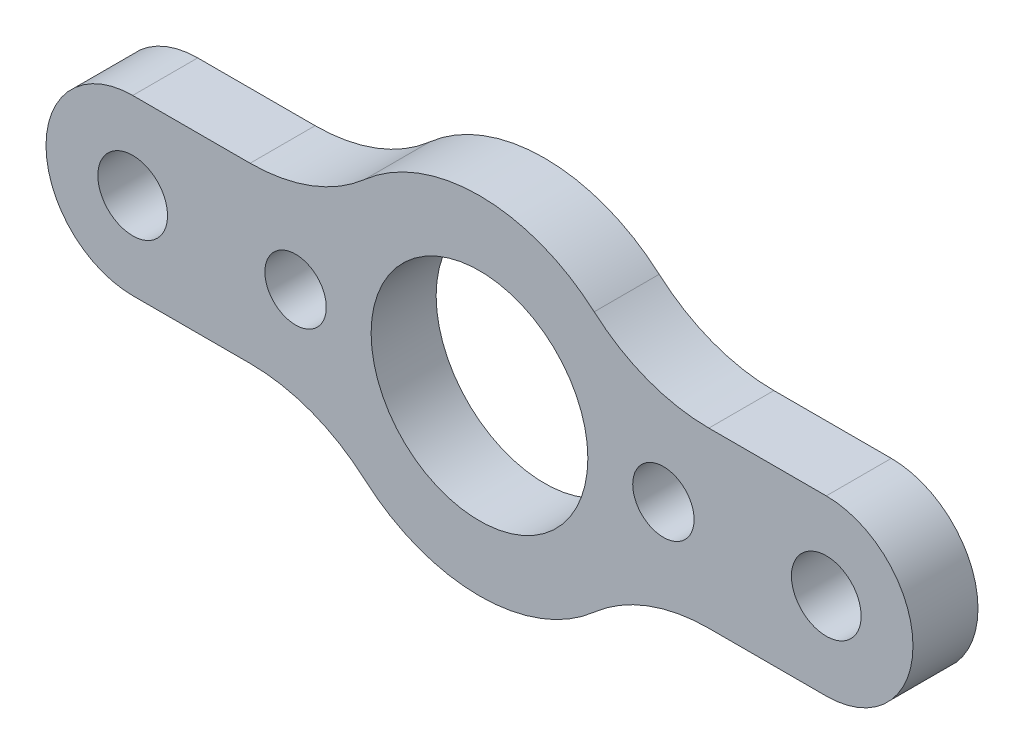
ISO-10303-21;
HEADER;
FILE_DESCRIPTION(('STEP AP214'),'2;1');
FILE_NAME('part.step','',(''),(''),'','','');
FILE_SCHEMA(('AUTOMOTIVE_DESIGN { 1 0 10303 214 1 1 1 1 }'));
ENDSEC;
DATA;
#1=APPLICATION_CONTEXT('core data for automotive mechanical design processes');
#2=APPLICATION_PROTOCOL_DEFINITION('international standard','automotive_design',2000,#1);
#3=PRODUCT_CONTEXT('',#1,'mechanical');
#4=PRODUCT('Part','Part','',(#3));
#5=PRODUCT_RELATED_PRODUCT_CATEGORY('part','',(#4));
#6=PRODUCT_DEFINITION_FORMATION('','',#4);
#7=PRODUCT_DEFINITION_CONTEXT('part definition',#1,'design');
#8=PRODUCT_DEFINITION('design','',#6,#7);
#9=PRODUCT_DEFINITION_SHAPE('','',#8);
#10=(LENGTH_UNIT() NAMED_UNIT(*) SI_UNIT(.MILLI.,.METRE.));
#11=(NAMED_UNIT(*) PLANE_ANGLE_UNIT() SI_UNIT($,.RADIAN.));
#12=(NAMED_UNIT(*) SI_UNIT($,.STERADIAN.) SOLID_ANGLE_UNIT());
#13=UNCERTAINTY_MEASURE_WITH_UNIT(LENGTH_MEASURE(1.E-05),#10,'distance_accuracy_value','');
#14=(GEOMETRIC_REPRESENTATION_CONTEXT(3) GLOBAL_UNCERTAINTY_ASSIGNED_CONTEXT((#13)) GLOBAL_UNIT_ASSIGNED_CONTEXT((#10,
#11,#12)) REPRESENTATION_CONTEXT('',''));
#15=CARTESIAN_POINT('',(0.,0.,0.));
#16=DIRECTION('',(0.,0.,1.));
#17=DIRECTION('',(1.,0.,0.));
#18=AXIS2_PLACEMENT_3D('',#15,#16,#17);
#19=CARTESIAN_POINT('',(16.8005208252602,19.05,0.));
#20=DIRECTION('',(0.,0.,-1.));
#21=DIRECTION('',(-1.,0.,0.));
#22=AXIS2_PLACEMENT_3D('',#19,#20,#21);
#23=PLANE('',#22);
#24=CARTESIAN_POINT('',(25.4,0.,0.));
#25=DIRECTION('',(0.,0.,-1.));
#26=DIRECTION('',(-1.,0.,0.));
#27=AXIS2_PLACEMENT_3D('',#24,#25,#26);
#28=CIRCLE('',#27,2.5527);
#29=CARTESIAN_POINT('',(22.8473,0.,0.));
#30=VERTEX_POINT('',#29);
#31=EDGE_CURVE('E179',#30,#30,#28,.F.);
#32=ORIENTED_EDGE('',*,*,#31,.T.);
#33=EDGE_LOOP('',(#32));
#34=FACE_BOUND('',#33,.T.);
#35=CARTESIAN_POINT('',(-13.4703841816037,0.,0.));
#36=DIRECTION('',(0.,0.,-1.));
#37=DIRECTION('',(-1.,0.,0.));
#38=AXIS2_PLACEMENT_3D('',#35,#36,#37);
#39=CIRCLE('',#38,2.2479);
#40=CARTESIAN_POINT('',(-15.7182841816037,0.,0.));
#41=VERTEX_POINT('',#40);
#42=EDGE_CURVE('E182',#41,#41,#39,.F.);
#43=ORIENTED_EDGE('',*,*,#42,.T.);
#44=EDGE_LOOP('',(#43));
#45=FACE_BOUND('',#44,.T.);
#46=CARTESIAN_POINT('',(0.,0.,0.));
#47=DIRECTION('',(0.,0.,-1.));
#48=DIRECTION('',(-1.,0.,0.));
#49=AXIS2_PLACEMENT_3D('',#46,#47,#48);
#50=CIRCLE('',#49,7.9375);
#51=CARTESIAN_POINT('',(-7.9375,0.,0.));
#52=VERTEX_POINT('',#51);
#53=EDGE_CURVE('E185',#52,#52,#50,.F.);
#54=ORIENTED_EDGE('',*,*,#53,.T.);
#55=EDGE_LOOP('',(#54));
#56=FACE_BOUND('',#55,.T.);
#57=CARTESIAN_POINT('',(-16.8005208252602,19.05,0.));
#58=DIRECTION('',(0.,0.,-1.));
#59=DIRECTION('',(-1.,0.,0.));
#60=AXIS2_PLACEMENT_3D('',#57,#58,#59);
#61=CIRCLE('',#60,12.7);
#62=CARTESIAN_POINT('',(-16.8005208252602,6.35,0.));
#63=VERTEX_POINT('',#62);
#64=CARTESIAN_POINT('',(-8.40026041263008,9.52499999999999,0.));
#65=VERTEX_POINT('',#64);
#66=EDGE_CURVE('E192',#63,#65,#61,.F.);
#67=ORIENTED_EDGE('',*,*,#66,.T.);
#68=CARTESIAN_POINT('',(0.,0.,0.));
#69=DIRECTION('',(0.,0.,-1.));
#70=DIRECTION('',(-1.,0.,0.));
#71=AXIS2_PLACEMENT_3D('',#68,#69,#70);
#72=CIRCLE('',#71,12.7);
#73=CARTESIAN_POINT('',(8.40026041263008,9.525,0.));
#74=VERTEX_POINT('',#73);
#75=EDGE_CURVE('E189',#74,#65,#72,.F.);
#76=ORIENTED_EDGE('',*,*,#75,.F.);
#77=CARTESIAN_POINT('',(16.8005208252602,19.05,0.));
#78=DIRECTION('',(0.,0.,-1.));
#79=DIRECTION('',(-1.,0.,0.));
#80=AXIS2_PLACEMENT_3D('',#77,#78,#79);
#81=CIRCLE('',#80,12.7);
#82=CARTESIAN_POINT('',(16.8005208252602,6.35,0.));
#83=VERTEX_POINT('',#82);
#84=EDGE_CURVE('E118',#74,#83,#81,.F.);
#85=ORIENTED_EDGE('',*,*,#84,.T.);
#86=DIRECTION('',(1.,0.,0.));
#87=VECTOR('',#86,1.);
#88=CARTESIAN_POINT('',(25.4,6.35000000000001,0.));
#89=LINE('',#88,#87);
#90=CARTESIAN_POINT('',(25.4,6.35,0.));
#91=VERTEX_POINT('',#90);
#92=EDGE_CURVE('E113',#83,#91,#89,.T.);
#93=ORIENTED_EDGE('',*,*,#92,.T.);
#94=CARTESIAN_POINT('',(25.4,0.,0.));
#95=DIRECTION('',(0.,0.,-1.));
#96=DIRECTION('',(-1.,0.,0.));
#97=AXIS2_PLACEMENT_3D('',#94,#95,#96);
#98=CIRCLE('',#97,6.35);
#99=CARTESIAN_POINT('',(25.4,-6.34999999999999,0.));
#100=VERTEX_POINT('',#99);
#101=EDGE_CURVE('E103',#100,#91,#98,.F.);
#102=ORIENTED_EDGE('',*,*,#101,.F.);
#103=DIRECTION('',(-1.,0.,0.));
#104=VECTOR('',#103,1.);
#105=CARTESIAN_POINT('',(25.4,-6.34999999999999,0.));
#106=LINE('',#105,#104);
#107=CARTESIAN_POINT('',(16.8005208252602,-6.35,0.));
#108=VERTEX_POINT('',#107);
#109=EDGE_CURVE('E129',#100,#108,#106,.T.);
#110=ORIENTED_EDGE('',*,*,#109,.T.);
#111=CARTESIAN_POINT('',(16.8005208252602,-19.05,0.));
#112=DIRECTION('',(0.,0.,-1.));
#113=DIRECTION('',(-1.,0.,0.));
#114=AXIS2_PLACEMENT_3D('',#111,#112,#113);
#115=CIRCLE('',#114,12.7);
#116=CARTESIAN_POINT('',(8.40026041263008,-9.525,0.));
#117=VERTEX_POINT('',#116);
#118=EDGE_CURVE('E202',#108,#117,#115,.F.);
#119=ORIENTED_EDGE('',*,*,#118,.T.);
#120=CARTESIAN_POINT('',(0.,0.,0.));
#121=DIRECTION('',(0.,0.,-1.));
#122=DIRECTION('',(-1.,0.,0.));
#123=AXIS2_PLACEMENT_3D('',#120,#121,#122);
#124=CIRCLE('',#123,12.7);
#125=CARTESIAN_POINT('',(-8.40026041263008,-9.525,0.));
#126=VERTEX_POINT('',#125);
#127=EDGE_CURVE('E199',#126,#117,#124,.F.);
#128=ORIENTED_EDGE('',*,*,#127,.F.);
#129=CARTESIAN_POINT('',(-16.8005208252602,-19.05,0.));
#130=DIRECTION('',(0.,0.,-1.));
#131=DIRECTION('',(-1.,0.,0.));
#132=AXIS2_PLACEMENT_3D('',#129,#130,#131);
#133=CIRCLE('',#132,12.7);
#134=CARTESIAN_POINT('',(-16.8005208252602,-6.35,0.));
#135=VERTEX_POINT('',#134);
#136=EDGE_CURVE('E196',#126,#135,#133,.F.);
#137=ORIENTED_EDGE('',*,*,#136,.T.);
#138=DIRECTION('',(-1.,0.,0.));
#139=VECTOR('',#138,1.);
#140=CARTESIAN_POINT('',(-25.4,-6.35,0.));
#141=LINE('',#140,#139);
#142=CARTESIAN_POINT('',(-25.4,-6.35,0.));
#143=VERTEX_POINT('',#142);
#144=EDGE_CURVE('E137',#135,#143,#141,.T.);
#145=ORIENTED_EDGE('',*,*,#144,.T.);
#146=CARTESIAN_POINT('',(-25.4,0.,0.));
#147=DIRECTION('',(0.,0.,-1.));
#148=DIRECTION('',(-1.,0.,0.));
#149=AXIS2_PLACEMENT_3D('',#146,#147,#148);
#150=CIRCLE('',#149,6.35);
#151=CARTESIAN_POINT('',(-25.4,6.35,0.));
#152=VERTEX_POINT('',#151);
#153=EDGE_CURVE('E194',#152,#143,#150,.F.);
#154=ORIENTED_EDGE('',*,*,#153,.F.);
#155=DIRECTION('',(1.,0.,0.));
#156=VECTOR('',#155,1.);
#157=CARTESIAN_POINT('',(-25.4,6.35,0.));
#158=LINE('',#157,#156);
#159=EDGE_CURVE('E133',#152,#63,#158,.T.);
#160=ORIENTED_EDGE('',*,*,#159,.T.);
#161=EDGE_LOOP('',(#67,#76,#85,#93,#102,#110,#119,#128,#137,#145,#154,#160));
#162=FACE_BOUND('',#161,.T.);
#163=CARTESIAN_POINT('',(13.4703841816037,0.,0.));
#164=DIRECTION('',(0.,0.,-1.));
#165=DIRECTION('',(-1.,0.,0.));
#166=AXIS2_PLACEMENT_3D('',#163,#164,#165);
#167=CIRCLE('',#166,2.2479);
#168=CARTESIAN_POINT('',(11.2224841816037,0.,0.));
#169=VERTEX_POINT('',#168);
#170=EDGE_CURVE('E122',#169,#169,#167,.F.);
#171=ORIENTED_EDGE('',*,*,#170,.T.);
#172=EDGE_LOOP('',(#171));
#173=FACE_BOUND('',#172,.T.);
#174=CARTESIAN_POINT('',(-25.4,0.,0.));
#175=DIRECTION('',(0.,0.,-1.));
#176=DIRECTION('',(-1.,0.,0.));
#177=AXIS2_PLACEMENT_3D('',#174,#175,#176);
#178=CIRCLE('',#177,2.5527);
#179=CARTESIAN_POINT('',(-27.9527,0.,0.));
#180=VERTEX_POINT('',#179);
#181=EDGE_CURVE('E20',#180,#180,#178,.F.);
#182=ORIENTED_EDGE('',*,*,#181,.T.);
#183=EDGE_LOOP('',(#182));
#184=FACE_BOUND('',#183,.T.);
#185=ADVANCED_FACE('F17',(#34,#45,#56,#162,#173,#184),#23,.T.);
#186=CARTESIAN_POINT('',(-25.4,0.,4.7625));
#187=DIRECTION('',(0.,0.,-1.));
#188=DIRECTION('',(-1.,0.,0.));
#189=AXIS2_PLACEMENT_3D('',#186,#187,#188);
#190=CYLINDRICAL_SURFACE('',#189,2.5527);
#191=ORIENTED_EDGE('',*,*,#181,.F.);
#192=EDGE_LOOP('',(#191));
#193=FACE_BOUND('',#192,.T.);
#194=CARTESIAN_POINT('',(-25.4,0.,4.7625));
#195=DIRECTION('',(0.,0.,-1.));
#196=DIRECTION('',(-1.,0.,0.));
#197=AXIS2_PLACEMENT_3D('',#194,#195,#196);
#198=CIRCLE('',#197,2.5527);
#199=CARTESIAN_POINT('',(-27.9527,0.,4.7625));
#200=VERTEX_POINT('',#199);
#201=EDGE_CURVE('E176',#200,#200,#198,.F.);
#202=ORIENTED_EDGE('',*,*,#201,.T.);
#203=EDGE_LOOP('',(#202));
#204=FACE_BOUND('',#203,.T.);
#205=ADVANCED_FACE('F210',(#193,#204),#190,.F.);
#206=CARTESIAN_POINT('',(13.4703841816037,0.,4.7625));
#207=DIRECTION('',(0.,0.,-1.));
#208=DIRECTION('',(-1.,0.,0.));
#209=AXIS2_PLACEMENT_3D('',#206,#207,#208);
#210=CYLINDRICAL_SURFACE('',#209,2.2479);
#211=ORIENTED_EDGE('',*,*,#170,.F.);
#212=EDGE_LOOP('',(#211));
#213=FACE_BOUND('',#212,.T.);
#214=CARTESIAN_POINT('',(13.4703841816037,0.,4.7625));
#215=DIRECTION('',(0.,0.,-1.));
#216=DIRECTION('',(-1.,0.,0.));
#217=AXIS2_PLACEMENT_3D('',#214,#215,#216);
#218=CIRCLE('',#217,2.2479);
#219=CARTESIAN_POINT('',(11.2224841816037,0.,4.7625));
#220=VERTEX_POINT('',#219);
#221=EDGE_CURVE('E173',#220,#220,#218,.F.);
#222=ORIENTED_EDGE('',*,*,#221,.T.);
#223=EDGE_LOOP('',(#222));
#224=FACE_BOUND('',#223,.T.);
#225=ADVANCED_FACE('F213',(#213,#224),#210,.F.);
#226=CARTESIAN_POINT('',(25.4,6.35000000000001,4.7625));
#227=DIRECTION('',(0.,-1.,0.));
#228=DIRECTION('',(1.,0.,0.));
#229=AXIS2_PLACEMENT_3D('',#226,#227,#228);
#230=PLANE('',#229);
#231=DIRECTION('',(0.,0.,-1.));
#232=VECTOR('',#231,1.);
#233=CARTESIAN_POINT('',(16.8005208252602,6.34999999999999,4.7625));
#234=LINE('',#233,#232);
#235=CARTESIAN_POINT('',(16.8005208252602,6.35,4.7625));
#236=VERTEX_POINT('',#235);
#237=EDGE_CURVE('E459',#83,#236,#234,.F.);
#238=ORIENTED_EDGE('',*,*,#237,.T.);
#239=DIRECTION('',(-1.,0.,0.));
#240=VECTOR('',#239,1.);
#241=CARTESIAN_POINT('',(16.8005208252602,6.35,4.7625));
#242=LINE('',#241,#240);
#243=CARTESIAN_POINT('',(25.4,6.35,4.7625));
#244=VERTEX_POINT('',#243);
#245=EDGE_CURVE('E127',#236,#244,#242,.F.);
#246=ORIENTED_EDGE('',*,*,#245,.T.);
#247=DIRECTION('',(0.,0.,-1.));
#248=VECTOR('',#247,1.);
#249=CARTESIAN_POINT('',(25.4,6.35,4.7625));
#250=LINE('',#249,#248);
#251=EDGE_CURVE('E110',#91,#244,#250,.F.);
#252=ORIENTED_EDGE('',*,*,#251,.F.);
#253=ORIENTED_EDGE('',*,*,#92,.F.);
#254=EDGE_LOOP('',(#238,#246,#252,#253));
#255=FACE_BOUND('',#254,.T.);
#256=ADVANCED_FACE('F125',(#255),#230,.F.);
#257=CARTESIAN_POINT('',(25.4,0.,4.7625));
#258=DIRECTION('',(0.,0.,-1.));
#259=DIRECTION('',(-1.,0.,0.));
#260=AXIS2_PLACEMENT_3D('',#257,#258,#259);
#261=CYLINDRICAL_SURFACE('',#260,6.35);
#262=CARTESIAN_POINT('',(25.4,0.,4.7625));
#263=DIRECTION('',(0.,0.,-1.));
#264=DIRECTION('',(-1.,0.,0.));
#265=AXIS2_PLACEMENT_3D('',#262,#263,#264);
#266=CIRCLE('',#265,6.35);
#267=CARTESIAN_POINT('',(25.4,-6.35,4.7625));
#268=VERTEX_POINT('',#267);
#269=EDGE_CURVE('E171',#244,#268,#266,.T.);
#270=ORIENTED_EDGE('',*,*,#269,.T.);
#271=DIRECTION('',(0.,0.,1.));
#272=VECTOR('',#271,1.);
#273=CARTESIAN_POINT('',(25.4,-6.34999999999999,4.7625));
#274=LINE('',#273,#272);
#275=EDGE_CURVE('E112',#268,#100,#274,.F.);
#276=ORIENTED_EDGE('',*,*,#275,.T.);
#277=ORIENTED_EDGE('',*,*,#101,.T.);
#278=ORIENTED_EDGE('',*,*,#251,.T.);
#279=EDGE_LOOP('',(#270,#276,#277,#278));
#280=FACE_BOUND('',#279,.T.);
#281=ADVANCED_FACE('F108',(#280),#261,.T.);
#282=CARTESIAN_POINT('',(25.4,-6.34999999999999,4.7625));
#283=DIRECTION('',(0.,1.,0.));
#284=DIRECTION('',(-1.,0.,0.));
#285=AXIS2_PLACEMENT_3D('',#282,#283,#284);
#286=PLANE('',#285);
#287=ORIENTED_EDGE('',*,*,#275,.F.);
#288=DIRECTION('',(-1.,0.,0.));
#289=VECTOR('',#288,1.);
#290=CARTESIAN_POINT('',(16.8005208252602,-6.35,4.7625));
#291=LINE('',#290,#289);
#292=CARTESIAN_POINT('',(16.8005208252602,-6.35,4.7625));
#293=VERTEX_POINT('',#292);
#294=EDGE_CURVE('E170',#268,#293,#291,.T.);
#295=ORIENTED_EDGE('',*,*,#294,.T.);
#296=DIRECTION('',(0.,0.,-1.));
#297=VECTOR('',#296,1.);
#298=CARTESIAN_POINT('',(16.8005208252602,-6.35,4.7625));
#299=LINE('',#298,#297);
#300=EDGE_CURVE('E142',#293,#108,#299,.T.);
#301=ORIENTED_EDGE('',*,*,#300,.T.);
#302=ORIENTED_EDGE('',*,*,#109,.F.);
#303=EDGE_LOOP('',(#287,#295,#301,#302));
#304=FACE_BOUND('',#303,.T.);
#305=ADVANCED_FACE('F272',(#304),#286,.F.);
#306=CARTESIAN_POINT('',(16.8005208252602,-19.05,4.7625));
#307=DIRECTION('',(0.,0.,-1.));
#308=DIRECTION('',(-1.,0.,0.));
#309=AXIS2_PLACEMENT_3D('',#306,#307,#308);
#310=CYLINDRICAL_SURFACE('',#309,12.7);
#311=ORIENTED_EDGE('',*,*,#300,.F.);
#312=CARTESIAN_POINT('',(16.8005208252602,-19.05,4.7625));
#313=DIRECTION('',(0.,0.,-1.));
#314=DIRECTION('',(-1.,0.,0.));
#315=AXIS2_PLACEMENT_3D('',#312,#313,#314);
#316=CIRCLE('',#315,12.7);
#317=CARTESIAN_POINT('',(8.40026041263008,-9.525,4.7625));
#318=VERTEX_POINT('',#317);
#319=EDGE_CURVE('E167',#293,#318,#316,.F.);
#320=ORIENTED_EDGE('',*,*,#319,.T.);
#321=DIRECTION('',(0.,0.,-1.));
#322=VECTOR('',#321,1.);
#323=CARTESIAN_POINT('',(8.40026041263008,-9.525,4.7625));
#324=LINE('',#323,#322);
#325=EDGE_CURVE('E201',#117,#318,#324,.F.);
#326=ORIENTED_EDGE('',*,*,#325,.F.);
#327=ORIENTED_EDGE('',*,*,#118,.F.);
#328=EDGE_LOOP('',(#311,#320,#326,#327));
#329=FACE_BOUND('',#328,.T.);
#330=ADVANCED_FACE('F268',(#329),#310,.F.);
#331=CARTESIAN_POINT('',(0.,0.,4.7625));
#332=DIRECTION('',(0.,0.,-1.));
#333=DIRECTION('',(-1.,0.,0.));
#334=AXIS2_PLACEMENT_3D('',#331,#332,#333);
#335=CYLINDRICAL_SURFACE('',#334,12.7);
#336=CARTESIAN_POINT('',(0.,0.,4.7625));
#337=DIRECTION('',(0.,0.,-1.));
#338=DIRECTION('',(-1.,0.,0.));
#339=AXIS2_PLACEMENT_3D('',#336,#337,#338);
#340=CIRCLE('',#339,12.7);
#341=CARTESIAN_POINT('',(-8.40026041263008,-9.525,4.7625));
#342=VERTEX_POINT('',#341);
#343=EDGE_CURVE('E164',#318,#342,#340,.T.);
#344=ORIENTED_EDGE('',*,*,#343,.T.);
#345=DIRECTION('',(0.,0.,-1.));
#346=VECTOR('',#345,1.);
#347=CARTESIAN_POINT('',(-8.40026041263008,-9.525,4.7625));
#348=LINE('',#347,#346);
#349=EDGE_CURVE('E198',#342,#126,#348,.T.);
#350=ORIENTED_EDGE('',*,*,#349,.T.);
#351=ORIENTED_EDGE('',*,*,#127,.T.);
#352=ORIENTED_EDGE('',*,*,#325,.T.);
#353=EDGE_LOOP('',(#344,#350,#351,#352));
#354=FACE_BOUND('',#353,.T.);
#355=ADVANCED_FACE('F264',(#354),#335,.T.);
#356=CARTESIAN_POINT('',(-16.8005208252602,-19.05,4.7625));
#357=DIRECTION('',(0.,0.,-1.));
#358=DIRECTION('',(-1.,0.,0.));
#359=AXIS2_PLACEMENT_3D('',#356,#357,#358);
#360=CYLINDRICAL_SURFACE('',#359,12.7);
#361=ORIENTED_EDGE('',*,*,#349,.F.);
#362=CARTESIAN_POINT('',(-16.8005208252602,-19.05,4.7625));
#363=DIRECTION('',(0.,0.,-1.));
#364=DIRECTION('',(-1.,0.,0.));
#365=AXIS2_PLACEMENT_3D('',#362,#363,#364);
#366=CIRCLE('',#365,12.7);
#367=CARTESIAN_POINT('',(-16.8005208252602,-6.35,4.7625));
#368=VERTEX_POINT('',#367);
#369=EDGE_CURVE('E161',#342,#368,#366,.F.);
#370=ORIENTED_EDGE('',*,*,#369,.T.);
#371=DIRECTION('',(0.,0.,1.));
#372=VECTOR('',#371,1.);
#373=CARTESIAN_POINT('',(-16.8005208252602,-6.35,4.7625));
#374=LINE('',#373,#372);
#375=EDGE_CURVE('E141',#368,#135,#374,.F.);
#376=ORIENTED_EDGE('',*,*,#375,.T.);
#377=ORIENTED_EDGE('',*,*,#136,.F.);
#378=EDGE_LOOP('',(#361,#370,#376,#377));
#379=FACE_BOUND('',#378,.T.);
#380=ADVANCED_FACE('F260',(#379),#360,.F.);
#381=CARTESIAN_POINT('',(-25.4,-6.35,4.7625));
#382=DIRECTION('',(0.,1.,0.));
#383=DIRECTION('',(-1.,0.,0.));
#384=AXIS2_PLACEMENT_3D('',#381,#382,#383);
#385=PLANE('',#384);
#386=ORIENTED_EDGE('',*,*,#375,.F.);
#387=DIRECTION('',(-1.,0.,0.));
#388=VECTOR('',#387,1.);
#389=CARTESIAN_POINT('',(16.8005208252602,-6.35,4.7625));
#390=LINE('',#389,#388);
#391=CARTESIAN_POINT('',(-25.4,-6.35,4.7625));
#392=VERTEX_POINT('',#391);
#393=EDGE_CURVE('E160',#368,#392,#390,.T.);
#394=ORIENTED_EDGE('',*,*,#393,.T.);
#395=DIRECTION('',(0.,0.,-1.));
#396=VECTOR('',#395,1.);
#397=CARTESIAN_POINT('',(-25.4,-6.35,4.7625));
#398=LINE('',#397,#396);
#399=EDGE_CURVE('E140',#143,#392,#398,.F.);
#400=ORIENTED_EDGE('',*,*,#399,.F.);
#401=ORIENTED_EDGE('',*,*,#144,.F.);
#402=EDGE_LOOP('',(#386,#394,#400,#401));
#403=FACE_BOUND('',#402,.T.);
#404=ADVANCED_FACE('F256',(#403),#385,.F.);
#405=CARTESIAN_POINT('',(-25.4,0.,4.7625));
#406=DIRECTION('',(0.,0.,-1.));
#407=DIRECTION('',(-1.,0.,0.));
#408=AXIS2_PLACEMENT_3D('',#405,#406,#407);
#409=CYLINDRICAL_SURFACE('',#408,6.35);
#410=DIRECTION('',(0.,0.,-1.));
#411=VECTOR('',#410,1.);
#412=CARTESIAN_POINT('',(-25.4,6.35,4.7625));
#413=LINE('',#412,#411);
#414=CARTESIAN_POINT('',(-25.4,6.35,4.7625));
#415=VERTEX_POINT('',#414);
#416=EDGE_CURVE('E136',#415,#152,#413,.T.);
#417=ORIENTED_EDGE('',*,*,#416,.T.);
#418=ORIENTED_EDGE('',*,*,#153,.T.);
#419=ORIENTED_EDGE('',*,*,#399,.T.);
#420=CARTESIAN_POINT('',(-25.4,0.,4.7625));
#421=DIRECTION('',(0.,0.,-1.));
#422=DIRECTION('',(-1.,0.,0.));
#423=AXIS2_PLACEMENT_3D('',#420,#421,#422);
#424=CIRCLE('',#423,6.35);
#425=EDGE_CURVE('E158',#392,#415,#424,.T.);
#426=ORIENTED_EDGE('',*,*,#425,.T.);
#427=EDGE_LOOP('',(#417,#418,#419,#426));
#428=FACE_BOUND('',#427,.T.);
#429=ADVANCED_FACE('F252',(#428),#409,.T.);
#430=CARTESIAN_POINT('',(-25.4,6.35,4.7625));
#431=DIRECTION('',(0.,-1.,0.));
#432=DIRECTION('',(0.,0.,-1.));
#433=AXIS2_PLACEMENT_3D('',#430,#431,#432);
#434=PLANE('',#433);
#435=ORIENTED_EDGE('',*,*,#416,.F.);
#436=DIRECTION('',(-1.,0.,0.));
#437=VECTOR('',#436,1.);
#438=CARTESIAN_POINT('',(16.8005208252602,6.35,4.7625));
#439=LINE('',#438,#437);
#440=CARTESIAN_POINT('',(-16.8005208252602,6.35,4.7625));
#441=VERTEX_POINT('',#440);
#442=EDGE_CURVE('E157',#415,#441,#439,.F.);
#443=ORIENTED_EDGE('',*,*,#442,.T.);
#444=DIRECTION('',(0.,0.,-1.));
#445=VECTOR('',#444,1.);
#446=CARTESIAN_POINT('',(-16.8005208252602,6.34999999999999,4.7625));
#447=LINE('',#446,#445);
#448=EDGE_CURVE('E135',#441,#63,#447,.T.);
#449=ORIENTED_EDGE('',*,*,#448,.T.);
#450=ORIENTED_EDGE('',*,*,#159,.F.);
#451=EDGE_LOOP('',(#435,#443,#449,#450));
#452=FACE_BOUND('',#451,.T.);
#453=ADVANCED_FACE('F248',(#452),#434,.F.);
#454=CARTESIAN_POINT('',(-16.8005208252602,19.05,4.7625));
#455=DIRECTION('',(0.,0.,-1.));
#456=DIRECTION('',(-1.,0.,0.));
#457=AXIS2_PLACEMENT_3D('',#454,#455,#456);
#458=CYLINDRICAL_SURFACE('',#457,12.7);
#459=ORIENTED_EDGE('',*,*,#448,.F.);
#460=CARTESIAN_POINT('',(-16.8005208252602,19.05,4.7625));
#461=DIRECTION('',(0.,0.,-1.));
#462=DIRECTION('',(-1.,0.,0.));
#463=AXIS2_PLACEMENT_3D('',#460,#461,#462);
#464=CIRCLE('',#463,12.7);
#465=CARTESIAN_POINT('',(-8.40026041263008,9.52499999999999,4.7625));
#466=VERTEX_POINT('',#465);
#467=EDGE_CURVE('E154',#441,#466,#464,.F.);
#468=ORIENTED_EDGE('',*,*,#467,.T.);
#469=DIRECTION('',(0.,0.,-1.));
#470=VECTOR('',#469,1.);
#471=CARTESIAN_POINT('',(-8.40026041263008,9.52499999999999,4.7625));
#472=LINE('',#471,#470);
#473=EDGE_CURVE('E191',#65,#466,#472,.F.);
#474=ORIENTED_EDGE('',*,*,#473,.F.);
#475=ORIENTED_EDGE('',*,*,#66,.F.);
#476=EDGE_LOOP('',(#459,#468,#474,#475));
#477=FACE_BOUND('',#476,.T.);
#478=ADVANCED_FACE('F244',(#477),#458,.F.);
#479=CARTESIAN_POINT('',(0.,0.,4.7625));
#480=DIRECTION('',(0.,0.,-1.));
#481=DIRECTION('',(-1.,0.,0.));
#482=AXIS2_PLACEMENT_3D('',#479,#480,#481);
#483=CYLINDRICAL_SURFACE('',#482,12.7);
#484=CARTESIAN_POINT('',(0.,0.,4.7625));
#485=DIRECTION('',(0.,0.,-1.));
#486=DIRECTION('',(-1.,0.,0.));
#487=AXIS2_PLACEMENT_3D('',#484,#485,#486);
#488=CIRCLE('',#487,12.7);
#489=CARTESIAN_POINT('',(8.40026041263008,9.525,4.7625));
#490=VERTEX_POINT('',#489);
#491=EDGE_CURVE('E151',#466,#490,#488,.T.);
#492=ORIENTED_EDGE('',*,*,#491,.T.);
#493=DIRECTION('',(0.,0.,-1.));
#494=VECTOR('',#493,1.);
#495=CARTESIAN_POINT('',(8.40026041263008,9.525,4.7625));
#496=LINE('',#495,#494);
#497=EDGE_CURVE('E35',#490,#74,#496,.T.);
#498=ORIENTED_EDGE('',*,*,#497,.T.);
#499=ORIENTED_EDGE('',*,*,#75,.T.);
#500=ORIENTED_EDGE('',*,*,#473,.T.);
#501=EDGE_LOOP('',(#492,#498,#499,#500));
#502=FACE_BOUND('',#501,.T.);
#503=ADVANCED_FACE('F241',(#502),#483,.T.);
#504=CARTESIAN_POINT('',(16.8005208252602,19.05,4.7625));
#505=DIRECTION('',(0.,0.,-1.));
#506=DIRECTION('',(-1.,0.,0.));
#507=AXIS2_PLACEMENT_3D('',#504,#505,#506);
#508=CYLINDRICAL_SURFACE('',#507,12.7);
#509=ORIENTED_EDGE('',*,*,#497,.F.);
#510=CARTESIAN_POINT('',(16.8005208252602,19.05,4.7625));
#511=DIRECTION('',(0.,0.,-1.));
#512=DIRECTION('',(-1.,0.,0.));
#513=AXIS2_PLACEMENT_3D('',#510,#511,#512);
#514=CIRCLE('',#513,12.7);
#515=EDGE_CURVE('E149',#490,#236,#514,.F.);
#516=ORIENTED_EDGE('',*,*,#515,.T.);
#517=ORIENTED_EDGE('',*,*,#237,.F.);
#518=ORIENTED_EDGE('',*,*,#84,.F.);
#519=EDGE_LOOP('',(#509,#516,#517,#518));
#520=FACE_BOUND('',#519,.T.);
#521=ADVANCED_FACE('F237',(#520),#508,.F.);
#522=CARTESIAN_POINT('',(0.,0.,4.7625));
#523=DIRECTION('',(0.,0.,-1.));
#524=DIRECTION('',(-1.,0.,0.));
#525=AXIS2_PLACEMENT_3D('',#522,#523,#524);
#526=CYLINDRICAL_SURFACE('',#525,7.9375);
#527=ORIENTED_EDGE('',*,*,#53,.F.);
#528=EDGE_LOOP('',(#527));
#529=FACE_BOUND('',#528,.T.);
#530=CARTESIAN_POINT('',(0.,0.,4.7625));
#531=DIRECTION('',(0.,0.,-1.));
#532=DIRECTION('',(-1.,0.,0.));
#533=AXIS2_PLACEMENT_3D('',#530,#531,#532);
#534=CIRCLE('',#533,7.9375);
#535=CARTESIAN_POINT('',(-7.9375,0.,4.7625));
#536=VERTEX_POINT('',#535);
#537=EDGE_CURVE('E146',#536,#536,#534,.F.);
#538=ORIENTED_EDGE('',*,*,#537,.T.);
#539=EDGE_LOOP('',(#538));
#540=FACE_BOUND('',#539,.T.);
#541=ADVANCED_FACE('F233',(#529,#540),#526,.F.);
#542=CARTESIAN_POINT('',(-13.4703841816037,0.,4.7625));
#543=DIRECTION('',(0.,0.,-1.));
#544=DIRECTION('',(-1.,0.,0.));
#545=AXIS2_PLACEMENT_3D('',#542,#543,#544);
#546=CYLINDRICAL_SURFACE('',#545,2.2479);
#547=ORIENTED_EDGE('',*,*,#42,.F.);
#548=EDGE_LOOP('',(#547));
#549=FACE_BOUND('',#548,.T.);
#550=CARTESIAN_POINT('',(-13.4703841816037,0.,4.7625));
#551=DIRECTION('',(0.,0.,-1.));
#552=DIRECTION('',(-1.,0.,0.));
#553=AXIS2_PLACEMENT_3D('',#550,#551,#552);
#554=CIRCLE('',#553,2.2479);
#555=CARTESIAN_POINT('',(-15.7182841816037,0.,4.7625));
#556=VERTEX_POINT('',#555);
#557=EDGE_CURVE('E26',#556,#556,#554,.F.);
#558=ORIENTED_EDGE('',*,*,#557,.T.);
#559=EDGE_LOOP('',(#558));
#560=FACE_BOUND('',#559,.T.);
#561=ADVANCED_FACE('F225',(#549,#560),#546,.F.);
#562=CARTESIAN_POINT('',(25.4,0.,4.7625));
#563=DIRECTION('',(0.,0.,-1.));
#564=DIRECTION('',(-1.,0.,0.));
#565=AXIS2_PLACEMENT_3D('',#562,#563,#564);
#566=CYLINDRICAL_SURFACE('',#565,2.5527);
#567=ORIENTED_EDGE('',*,*,#31,.F.);
#568=EDGE_LOOP('',(#567));
#569=FACE_BOUND('',#568,.T.);
#570=CARTESIAN_POINT('',(25.4,0.,4.7625));
#571=DIRECTION('',(0.,0.,-1.));
#572=DIRECTION('',(-1.,0.,0.));
#573=AXIS2_PLACEMENT_3D('',#570,#571,#572);
#574=CIRCLE('',#573,2.5527);
#575=CARTESIAN_POINT('',(22.8473,0.,4.7625));
#576=VERTEX_POINT('',#575);
#577=EDGE_CURVE('E11',#576,#576,#574,.F.);
#578=ORIENTED_EDGE('',*,*,#577,.T.);
#579=EDGE_LOOP('',(#578));
#580=FACE_BOUND('',#579,.T.);
#581=ADVANCED_FACE('F218',(#569,#580),#566,.F.);
#582=CARTESIAN_POINT('',(16.8005208252602,19.05,4.7625));
#583=DIRECTION('',(0.,0.,-1.));
#584=DIRECTION('',(-1.,0.,0.));
#585=AXIS2_PLACEMENT_3D('',#582,#583,#584);
#586=PLANE('',#585);
#587=ORIENTED_EDGE('',*,*,#577,.F.);
#588=EDGE_LOOP('',(#587));
#589=FACE_BOUND('',#588,.T.);
#590=ORIENTED_EDGE('',*,*,#557,.F.);
#591=EDGE_LOOP('',(#590));
#592=FACE_BOUND('',#591,.T.);
#593=ORIENTED_EDGE('',*,*,#537,.F.);
#594=EDGE_LOOP('',(#593));
#595=FACE_BOUND('',#594,.T.);
#596=ORIENTED_EDGE('',*,*,#491,.F.);
#597=ORIENTED_EDGE('',*,*,#467,.F.);
#598=ORIENTED_EDGE('',*,*,#442,.F.);
#599=ORIENTED_EDGE('',*,*,#425,.F.);
#600=ORIENTED_EDGE('',*,*,#393,.F.);
#601=ORIENTED_EDGE('',*,*,#369,.F.);
#602=ORIENTED_EDGE('',*,*,#343,.F.);
#603=ORIENTED_EDGE('',*,*,#319,.F.);
#604=ORIENTED_EDGE('',*,*,#294,.F.);
#605=ORIENTED_EDGE('',*,*,#269,.F.);
#606=ORIENTED_EDGE('',*,*,#245,.F.);
#607=ORIENTED_EDGE('',*,*,#515,.F.);
#608=EDGE_LOOP('',(#596,#597,#598,#599,#600,#601,#602,#603,#604,#605,#606,#607));
#609=FACE_BOUND('',#608,.T.);
#610=ORIENTED_EDGE('',*,*,#221,.F.);
#611=EDGE_LOOP('',(#610));
#612=FACE_BOUND('',#611,.T.);
#613=ORIENTED_EDGE('',*,*,#201,.F.);
#614=EDGE_LOOP('',(#613));
#615=FACE_BOUND('',#614,.T.);
#616=ADVANCED_FACE('F216',(#589,#592,#595,#609,#612,#615),#586,.F.);
#617=CLOSED_SHELL('',(#185,#205,#225,#256,#281,#305,#330,#355,#380,#404,#429,#453,#478,#503,
#521,#541,#561,#581,#616));
#618=MANIFOLD_SOLID_BREP('B1',#617);
#619=ADVANCED_BREP_SHAPE_REPRESENTATION('',(#18,#618),#14);
#620=SHAPE_DEFINITION_REPRESENTATION(#9,#619);
ENDSEC;
END-ISO-10303-21;
